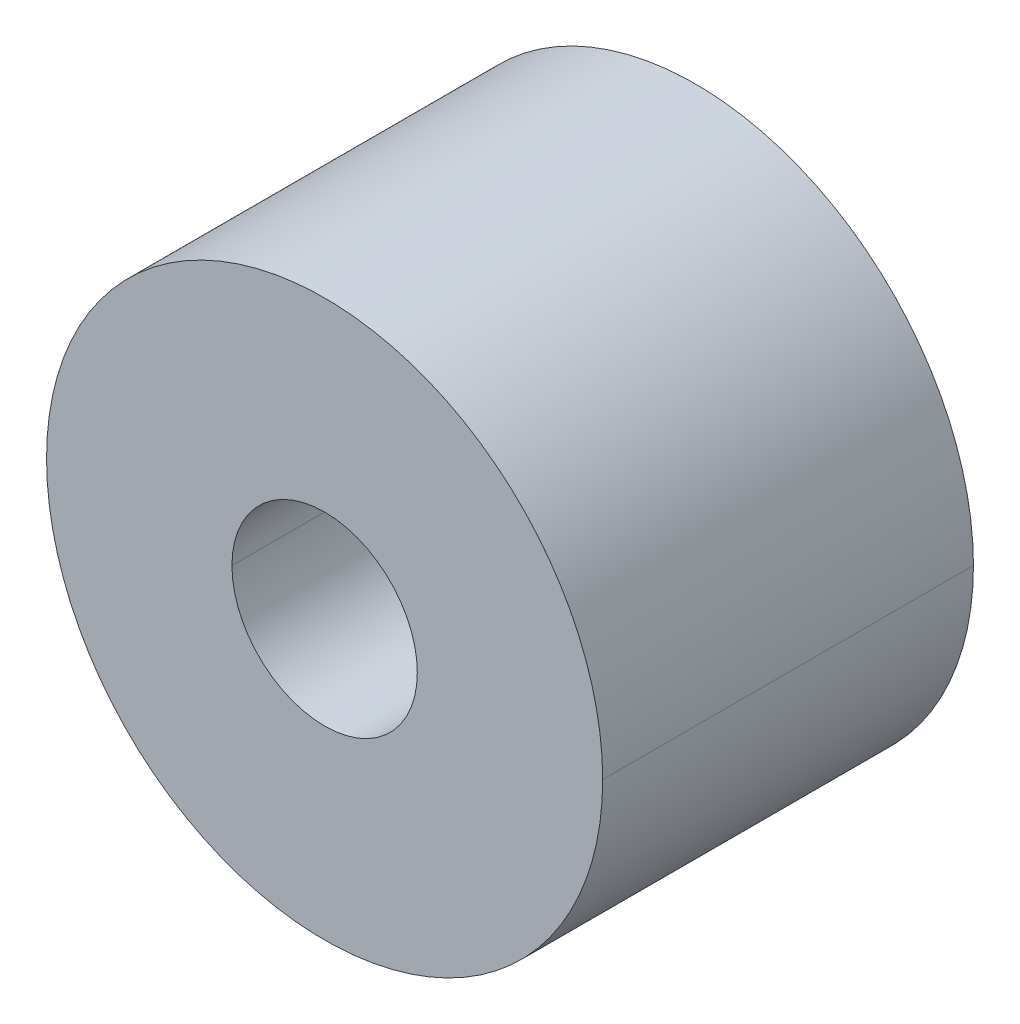
ISO-10303-21;
HEADER;
FILE_DESCRIPTION(('STEP AP214'),'2;1');
FILE_NAME('part.step','',(''),(''),'','','');
FILE_SCHEMA(('AUTOMOTIVE_DESIGN { 1 0 10303 214 1 1 1 1 }'));
ENDSEC;
DATA;
#1=APPLICATION_CONTEXT('core data for automotive mechanical design processes');
#2=APPLICATION_PROTOCOL_DEFINITION('international standard','automotive_design',2000,#1);
#3=PRODUCT_CONTEXT('',#1,'mechanical');
#4=PRODUCT('Part','Part','',(#3));
#5=PRODUCT_RELATED_PRODUCT_CATEGORY('part','',(#4));
#6=PRODUCT_DEFINITION_FORMATION('','',#4);
#7=PRODUCT_DEFINITION_CONTEXT('part definition',#1,'design');
#8=PRODUCT_DEFINITION('design','',#6,#7);
#9=PRODUCT_DEFINITION_SHAPE('','',#8);
#10=(LENGTH_UNIT() NAMED_UNIT(*) SI_UNIT(.MILLI.,.METRE.));
#11=(NAMED_UNIT(*) PLANE_ANGLE_UNIT() SI_UNIT($,.RADIAN.));
#12=(NAMED_UNIT(*) SI_UNIT($,.STERADIAN.) SOLID_ANGLE_UNIT());
#13=UNCERTAINTY_MEASURE_WITH_UNIT(LENGTH_MEASURE(1.E-05),#10,'distance_accuracy_value','');
#14=(GEOMETRIC_REPRESENTATION_CONTEXT(3) GLOBAL_UNCERTAINTY_ASSIGNED_CONTEXT((#13)) GLOBAL_UNIT_ASSIGNED_CONTEXT((#10,
#11,#12)) REPRESENTATION_CONTEXT('',''));
#15=CARTESIAN_POINT('',(0.,0.,0.));
#16=DIRECTION('',(0.,0.,1.));
#17=DIRECTION('',(1.,0.,0.));
#18=AXIS2_PLACEMENT_3D('',#15,#16,#17);
#19=CARTESIAN_POINT('',(0.,0.,0.));
#20=DIRECTION('',(0.,0.,1.));
#21=DIRECTION('',(1.,0.,0.));
#22=AXIS2_PLACEMENT_3D('',#19,#20,#21);
#23=CYLINDRICAL_SURFACE('',#22,25.);
#24=DIRECTION('',(0.,0.,-1.));
#25=VECTOR('',#24,1.);
#26=CARTESIAN_POINT('',(-25.,0.,0.));
#27=LINE('',#26,#25);
#28=CARTESIAN_POINT('',(-25.,0.,0.));
#29=VERTEX_POINT('',#28);
#30=CARTESIAN_POINT('',(-25.,0.,-100.));
#31=VERTEX_POINT('',#30);
#32=EDGE_CURVE('E19',#29,#31,#27,.T.);
#33=ORIENTED_EDGE('',*,*,#32,.T.);
#34=CARTESIAN_POINT('',(0.,0.,-100.));
#35=DIRECTION('',(0.,0.,-1.));
#36=DIRECTION('',(-1.,0.,0.));
#37=AXIS2_PLACEMENT_3D('',#34,#35,#36);
#38=CIRCLE('',#37,25.);
#39=CARTESIAN_POINT('',(25.,0.,-100.));
#40=VERTEX_POINT('',#39);
#41=EDGE_CURVE('E34',#31,#40,#38,.T.);
#42=ORIENTED_EDGE('',*,*,#41,.T.);
#43=DIRECTION('',(0.,0.,-1.));
#44=VECTOR('',#43,1.);
#45=CARTESIAN_POINT('',(25.,0.,0.));
#46=LINE('',#45,#44);
#47=CARTESIAN_POINT('',(25.,0.,0.));
#48=VERTEX_POINT('',#47);
#49=EDGE_CURVE('E10',#48,#40,#46,.T.);
#50=ORIENTED_EDGE('',*,*,#49,.F.);
#51=CARTESIAN_POINT('',(0.,0.,0.));
#52=DIRECTION('',(0.,0.,-1.));
#53=DIRECTION('',(-1.,0.,0.));
#54=AXIS2_PLACEMENT_3D('',#51,#52,#53);
#55=CIRCLE('',#54,25.);
#56=EDGE_CURVE('E75',#29,#48,#55,.T.);
#57=ORIENTED_EDGE('',*,*,#56,.F.);
#58=EDGE_LOOP('',(#33,#42,#50,#57));
#59=FACE_BOUND('',#58,.T.);
#60=ADVANCED_FACE('F16',(#59),#23,.F.);
#61=CARTESIAN_POINT('',(0.,0.,0.));
#62=DIRECTION('',(0.,0.,1.));
#63=DIRECTION('',(1.,0.,0.));
#64=AXIS2_PLACEMENT_3D('',#61,#62,#63);
#65=CYLINDRICAL_SURFACE('',#64,25.);
#66=ORIENTED_EDGE('',*,*,#49,.T.);
#67=CARTESIAN_POINT('',(0.,0.,-100.));
#68=DIRECTION('',(0.,0.,-1.));
#69=DIRECTION('',(1.,0.,0.));
#70=AXIS2_PLACEMENT_3D('',#67,#68,#69);
#71=CIRCLE('',#70,25.);
#72=EDGE_CURVE('E83',#40,#31,#71,.T.);
#73=ORIENTED_EDGE('',*,*,#72,.T.);
#74=ORIENTED_EDGE('',*,*,#32,.F.);
#75=CARTESIAN_POINT('',(0.,0.,0.));
#76=DIRECTION('',(0.,0.,-1.));
#77=DIRECTION('',(1.,0.,0.));
#78=AXIS2_PLACEMENT_3D('',#75,#76,#77);
#79=CIRCLE('',#78,25.);
#80=EDGE_CURVE('E72',#48,#29,#79,.T.);
#81=ORIENTED_EDGE('',*,*,#80,.F.);
#82=EDGE_LOOP('',(#66,#73,#74,#81));
#83=FACE_BOUND('',#82,.T.);
#84=ADVANCED_FACE('F87',(#83),#65,.F.);
#85=CARTESIAN_POINT('',(0.,0.,-100.));
#86=DIRECTION('',(0.,0.,1.));
#87=DIRECTION('',(1.,0.,0.));
#88=AXIS2_PLACEMENT_3D('',#85,#86,#87);
#89=PLANE('',#88);
#90=ORIENTED_EDGE('',*,*,#41,.F.);
#91=ORIENTED_EDGE('',*,*,#72,.F.);
#92=EDGE_LOOP('',(#90,#91));
#93=FACE_BOUND('',#92,.T.);
#94=CARTESIAN_POINT('',(0.,0.,-100.));
#95=DIRECTION('',(0.,0.,1.));
#96=DIRECTION('',(-1.,0.,0.));
#97=AXIS2_PLACEMENT_3D('',#94,#95,#96);
#98=CIRCLE('',#97,75.);
#99=CARTESIAN_POINT('',(-75.,0.,-100.));
#100=VERTEX_POINT('',#99);
#101=CARTESIAN_POINT('',(75.,0.,-100.));
#102=VERTEX_POINT('',#101);
#103=EDGE_CURVE('E60',#100,#102,#98,.T.);
#104=ORIENTED_EDGE('',*,*,#103,.F.);
#105=CARTESIAN_POINT('',(0.,0.,-100.));
#106=DIRECTION('',(0.,0.,1.));
#107=DIRECTION('',(1.,0.,0.));
#108=AXIS2_PLACEMENT_3D('',#105,#106,#107);
#109=CIRCLE('',#108,75.);
#110=EDGE_CURVE('E63',#102,#100,#109,.T.);
#111=ORIENTED_EDGE('',*,*,#110,.F.);
#112=EDGE_LOOP('',(#104,#111));
#113=FACE_BOUND('',#112,.T.);
#114=ADVANCED_FACE('F90',(#93,#113),#89,.F.);
#115=CARTESIAN_POINT('',(0.,0.,0.));
#116=DIRECTION('',(0.,0.,1.));
#117=DIRECTION('',(1.,0.,0.));
#118=AXIS2_PLACEMENT_3D('',#115,#116,#117);
#119=CYLINDRICAL_SURFACE('',#118,75.);
#120=DIRECTION('',(0.,0.,-1.));
#121=VECTOR('',#120,1.);
#122=CARTESIAN_POINT('',(-75.,0.,0.));
#123=LINE('',#122,#121);
#124=CARTESIAN_POINT('',(-75.,0.,0.));
#125=VERTEX_POINT('',#124);
#126=EDGE_CURVE('E68',#125,#100,#123,.T.);
#127=ORIENTED_EDGE('',*,*,#126,.T.);
#128=ORIENTED_EDGE('',*,*,#103,.T.);
#129=DIRECTION('',(0.,0.,-1.));
#130=VECTOR('',#129,1.);
#131=CARTESIAN_POINT('',(75.,0.,0.));
#132=LINE('',#131,#130);
#133=CARTESIAN_POINT('',(75.,0.,0.));
#134=VERTEX_POINT('',#133);
#135=EDGE_CURVE('E53',#134,#102,#132,.T.);
#136=ORIENTED_EDGE('',*,*,#135,.F.);
#137=CARTESIAN_POINT('',(0.,0.,0.));
#138=DIRECTION('',(0.,0.,1.));
#139=DIRECTION('',(-1.,0.,0.));
#140=AXIS2_PLACEMENT_3D('',#137,#138,#139);
#141=CIRCLE('',#140,75.);
#142=EDGE_CURVE('E58',#125,#134,#141,.T.);
#143=ORIENTED_EDGE('',*,*,#142,.F.);
#144=EDGE_LOOP('',(#127,#128,#136,#143));
#145=FACE_BOUND('',#144,.T.);
#146=ADVANCED_FACE('F56',(#145),#119,.T.);
#147=CARTESIAN_POINT('',(0.,0.,0.));
#148=DIRECTION('',(0.,0.,1.));
#149=DIRECTION('',(1.,0.,0.));
#150=AXIS2_PLACEMENT_3D('',#147,#148,#149);
#151=CYLINDRICAL_SURFACE('',#150,75.);
#152=ORIENTED_EDGE('',*,*,#135,.T.);
#153=ORIENTED_EDGE('',*,*,#110,.T.);
#154=ORIENTED_EDGE('',*,*,#126,.F.);
#155=CARTESIAN_POINT('',(0.,0.,0.));
#156=DIRECTION('',(0.,0.,1.));
#157=DIRECTION('',(1.,0.,0.));
#158=AXIS2_PLACEMENT_3D('',#155,#156,#157);
#159=CIRCLE('',#158,75.);
#160=EDGE_CURVE('E66',#134,#125,#159,.T.);
#161=ORIENTED_EDGE('',*,*,#160,.F.);
#162=EDGE_LOOP('',(#152,#153,#154,#161));
#163=FACE_BOUND('',#162,.T.);
#164=ADVANCED_FACE('F67',(#163),#151,.T.);
#165=CARTESIAN_POINT('',(0.,0.,0.));
#166=DIRECTION('',(0.,0.,1.));
#167=DIRECTION('',(1.,0.,0.));
#168=AXIS2_PLACEMENT_3D('',#165,#166,#167);
#169=PLANE('',#168);
#170=ORIENTED_EDGE('',*,*,#56,.T.);
#171=ORIENTED_EDGE('',*,*,#80,.T.);
#172=EDGE_LOOP('',(#170,#171));
#173=FACE_BOUND('',#172,.T.);
#174=ORIENTED_EDGE('',*,*,#142,.T.);
#175=ORIENTED_EDGE('',*,*,#160,.T.);
#176=EDGE_LOOP('',(#174,#175));
#177=FACE_BOUND('',#176,.T.);
#178=ADVANCED_FACE('F71',(#173,#177),#169,.T.);
#179=CLOSED_SHELL('',(#60,#84,#114,#146,#164,#178));
#180=MANIFOLD_SOLID_BREP('B1',#179);
#181=ADVANCED_BREP_SHAPE_REPRESENTATION('',(#18,#180),#14);
#182=SHAPE_DEFINITION_REPRESENTATION(#9,#181);
ENDSEC;
END-ISO-10303-21;
